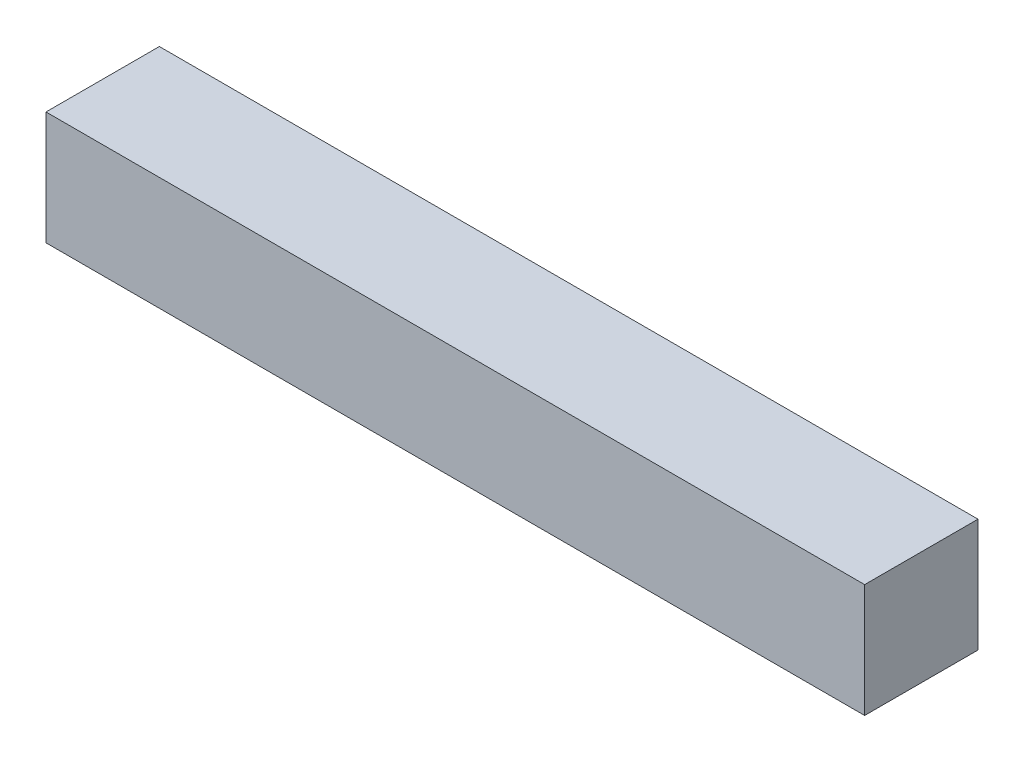
ISO-10303-21;
HEADER;
FILE_DESCRIPTION(('STEP AP214'),'2;1');
FILE_NAME('part.step','',(''),(''),'','','');
FILE_SCHEMA(('AUTOMOTIVE_DESIGN { 1 0 10303 214 1 1 1 1 }'));
ENDSEC;
DATA;
#1=APPLICATION_CONTEXT('core data for automotive mechanical design processes');
#2=APPLICATION_PROTOCOL_DEFINITION('international standard','automotive_design',2000,#1);
#3=PRODUCT_CONTEXT('',#1,'mechanical');
#4=PRODUCT('Part','Part','',(#3));
#5=PRODUCT_RELATED_PRODUCT_CATEGORY('part','',(#4));
#6=PRODUCT_DEFINITION_FORMATION('','',#4);
#7=PRODUCT_DEFINITION_CONTEXT('part definition',#1,'design');
#8=PRODUCT_DEFINITION('design','',#6,#7);
#9=PRODUCT_DEFINITION_SHAPE('','',#8);
#10=(LENGTH_UNIT() NAMED_UNIT(*) SI_UNIT(.MILLI.,.METRE.));
#11=(NAMED_UNIT(*) PLANE_ANGLE_UNIT() SI_UNIT($,.RADIAN.));
#12=(NAMED_UNIT(*) SI_UNIT($,.STERADIAN.) SOLID_ANGLE_UNIT());
#13=UNCERTAINTY_MEASURE_WITH_UNIT(LENGTH_MEASURE(1.E-05),#10,'distance_accuracy_value','');
#14=(GEOMETRIC_REPRESENTATION_CONTEXT(3) GLOBAL_UNCERTAINTY_ASSIGNED_CONTEXT((#13)) GLOBAL_UNIT_ASSIGNED_CONTEXT((#10,
#11,#12)) REPRESENTATION_CONTEXT('',''));
#15=CARTESIAN_POINT('',(0.,0.,0.));
#16=DIRECTION('',(0.,0.,1.));
#17=DIRECTION('',(1.,0.,0.));
#18=AXIS2_PLACEMENT_3D('',#15,#16,#17);
#19=CARTESIAN_POINT('',(0.,0.,9.));
#20=DIRECTION('',(1.,0.,0.));
#21=DIRECTION('',(0.,0.,-1.));
#22=AXIS2_PLACEMENT_3D('',#19,#20,#21);
#23=PLANE('',#22);
#24=DIRECTION('',(0.,-1.,0.));
#25=VECTOR('',#24,1.);
#26=CARTESIAN_POINT('',(0.,0.,0.));
#27=LINE('',#26,#25);
#28=CARTESIAN_POINT('',(0.,0.,0.));
#29=VERTEX_POINT('',#28);
#30=CARTESIAN_POINT('',(0.,-9.,0.));
#31=VERTEX_POINT('',#30);
#32=EDGE_CURVE('E96',#29,#31,#27,.T.);
#33=ORIENTED_EDGE('',*,*,#32,.T.);
#34=DIRECTION('',(0.,0.,-1.));
#35=VECTOR('',#34,1.);
#36=CARTESIAN_POINT('',(0.,-9.,9.));
#37=LINE('',#36,#35);
#38=CARTESIAN_POINT('',(0.,-9.,9.));
#39=VERTEX_POINT('',#38);
#40=EDGE_CURVE('E11',#39,#31,#37,.T.);
#41=ORIENTED_EDGE('',*,*,#40,.F.);
#42=DIRECTION('',(0.,-1.,0.));
#43=VECTOR('',#42,1.);
#44=CARTESIAN_POINT('',(0.,0.,9.));
#45=LINE('',#44,#43);
#46=CARTESIAN_POINT('',(0.,0.,9.));
#47=VERTEX_POINT('',#46);
#48=EDGE_CURVE('E84',#47,#39,#45,.T.);
#49=ORIENTED_EDGE('',*,*,#48,.F.);
#50=DIRECTION('',(0.,0.,-1.));
#51=VECTOR('',#50,1.);
#52=CARTESIAN_POINT('',(0.,0.,9.));
#53=LINE('',#52,#51);
#54=EDGE_CURVE('E92',#47,#29,#53,.T.);
#55=ORIENTED_EDGE('',*,*,#54,.T.);
#56=EDGE_LOOP('',(#33,#41,#49,#55));
#57=FACE_BOUND('',#56,.T.);
#58=ADVANCED_FACE('F33',(#57),#23,.F.);
#59=CARTESIAN_POINT('',(0.,-9.,9.));
#60=DIRECTION('',(0.,1.,0.));
#61=DIRECTION('',(0.,0.,1.));
#62=AXIS2_PLACEMENT_3D('',#59,#60,#61);
#63=PLANE('',#62);
#64=DIRECTION('',(1.,0.,0.));
#65=VECTOR('',#64,1.);
#66=CARTESIAN_POINT('',(0.,-9.,0.));
#67=LINE('',#66,#65);
#68=CARTESIAN_POINT('',(65.,-9.,0.));
#69=VERTEX_POINT('',#68);
#70=EDGE_CURVE('E88',#31,#69,#67,.T.);
#71=ORIENTED_EDGE('',*,*,#70,.T.);
#72=DIRECTION('',(0.,0.,-1.));
#73=VECTOR('',#72,1.);
#74=CARTESIAN_POINT('',(65.,-9.,9.));
#75=LINE('',#74,#73);
#76=CARTESIAN_POINT('',(65.,-9.,9.));
#77=VERTEX_POINT('',#76);
#78=EDGE_CURVE('E41',#77,#69,#75,.T.);
#79=ORIENTED_EDGE('',*,*,#78,.F.);
#80=DIRECTION('',(1.,0.,0.));
#81=VECTOR('',#80,1.);
#82=CARTESIAN_POINT('',(0.,-9.,9.));
#83=LINE('',#82,#81);
#84=EDGE_CURVE('E79',#39,#77,#83,.T.);
#85=ORIENTED_EDGE('',*,*,#84,.F.);
#86=ORIENTED_EDGE('',*,*,#40,.T.);
#87=EDGE_LOOP('',(#71,#79,#85,#86));
#88=FACE_BOUND('',#87,.T.);
#89=ADVANCED_FACE('F87',(#88),#63,.F.);
#90=CARTESIAN_POINT('',(65.,0.,9.));
#91=DIRECTION('',(-1.,0.,0.));
#92=DIRECTION('',(0.,0.,1.));
#93=AXIS2_PLACEMENT_3D('',#90,#91,#92);
#94=PLANE('',#93);
#95=DIRECTION('',(0.,1.,0.));
#96=VECTOR('',#95,1.);
#97=CARTESIAN_POINT('',(65.,0.,0.));
#98=LINE('',#97,#96);
#99=CARTESIAN_POINT('',(65.,0.,0.));
#100=VERTEX_POINT('',#99);
#101=EDGE_CURVE('E66',#69,#100,#98,.T.);
#102=ORIENTED_EDGE('',*,*,#101,.T.);
#103=DIRECTION('',(0.,0.,-1.));
#104=VECTOR('',#103,1.);
#105=CARTESIAN_POINT('',(65.,0.,9.));
#106=LINE('',#105,#104);
#107=CARTESIAN_POINT('',(65.,0.,9.));
#108=VERTEX_POINT('',#107);
#109=EDGE_CURVE('E89',#108,#100,#106,.T.);
#110=ORIENTED_EDGE('',*,*,#109,.F.);
#111=DIRECTION('',(0.,1.,0.));
#112=VECTOR('',#111,1.);
#113=CARTESIAN_POINT('',(65.,0.,9.));
#114=LINE('',#113,#112);
#115=EDGE_CURVE('E82',#77,#108,#114,.T.);
#116=ORIENTED_EDGE('',*,*,#115,.F.);
#117=ORIENTED_EDGE('',*,*,#78,.T.);
#118=EDGE_LOOP('',(#102,#110,#116,#117));
#119=FACE_BOUND('',#118,.T.);
#120=ADVANCED_FACE('F90',(#119),#94,.F.);
#121=CARTESIAN_POINT('',(0.,0.,9.));
#122=DIRECTION('',(0.,-1.,0.));
#123=DIRECTION('',(0.,0.,-1.));
#124=AXIS2_PLACEMENT_3D('',#121,#122,#123);
#125=PLANE('',#124);
#126=DIRECTION('',(-1.,0.,0.));
#127=VECTOR('',#126,1.);
#128=CARTESIAN_POINT('',(0.,0.,0.));
#129=LINE('',#128,#127);
#130=EDGE_CURVE('E72',#100,#29,#129,.T.);
#131=ORIENTED_EDGE('',*,*,#130,.T.);
#132=ORIENTED_EDGE('',*,*,#54,.F.);
#133=DIRECTION('',(-1.,0.,0.));
#134=VECTOR('',#133,1.);
#135=CARTESIAN_POINT('',(0.,0.,9.));
#136=LINE('',#135,#134);
#137=EDGE_CURVE('E49',#108,#47,#136,.T.);
#138=ORIENTED_EDGE('',*,*,#137,.F.);
#139=ORIENTED_EDGE('',*,*,#109,.T.);
#140=EDGE_LOOP('',(#131,#132,#138,#139));
#141=FACE_BOUND('',#140,.T.);
#142=ADVANCED_FACE('F103',(#141),#125,.F.);
#143=CARTESIAN_POINT('',(0.,0.,9.));
#144=DIRECTION('',(0.,0.,1.));
#145=DIRECTION('',(1.,0.,0.));
#146=AXIS2_PLACEMENT_3D('',#143,#144,#145);
#147=PLANE('',#146);
#148=ORIENTED_EDGE('',*,*,#48,.T.);
#149=ORIENTED_EDGE('',*,*,#84,.T.);
#150=ORIENTED_EDGE('',*,*,#115,.T.);
#151=ORIENTED_EDGE('',*,*,#137,.T.);
#152=EDGE_LOOP('',(#148,#149,#150,#151));
#153=FACE_BOUND('',#152,.T.);
#154=ADVANCED_FACE('F80',(#153),#147,.T.);
#155=CARTESIAN_POINT('',(0.,0.,0.));
#156=DIRECTION('',(0.,0.,1.));
#157=DIRECTION('',(1.,0.,0.));
#158=AXIS2_PLACEMENT_3D('',#155,#156,#157);
#159=PLANE('',#158);
#160=ORIENTED_EDGE('',*,*,#32,.F.);
#161=ORIENTED_EDGE('',*,*,#130,.F.);
#162=ORIENTED_EDGE('',*,*,#101,.F.);
#163=ORIENTED_EDGE('',*,*,#70,.F.);
#164=EDGE_LOOP('',(#160,#161,#162,#163));
#165=FACE_BOUND('',#164,.T.);
#166=ADVANCED_FACE('F106',(#165),#159,.F.);
#167=CLOSED_SHELL('',(#58,#89,#120,#142,#154,#166));
#168=MANIFOLD_SOLID_BREP('B2',#167);
#169=ADVANCED_BREP_SHAPE_REPRESENTATION('',(#18,#168),#14);
#170=SHAPE_DEFINITION_REPRESENTATION(#9,#169);
ENDSEC;
END-ISO-10303-21;
